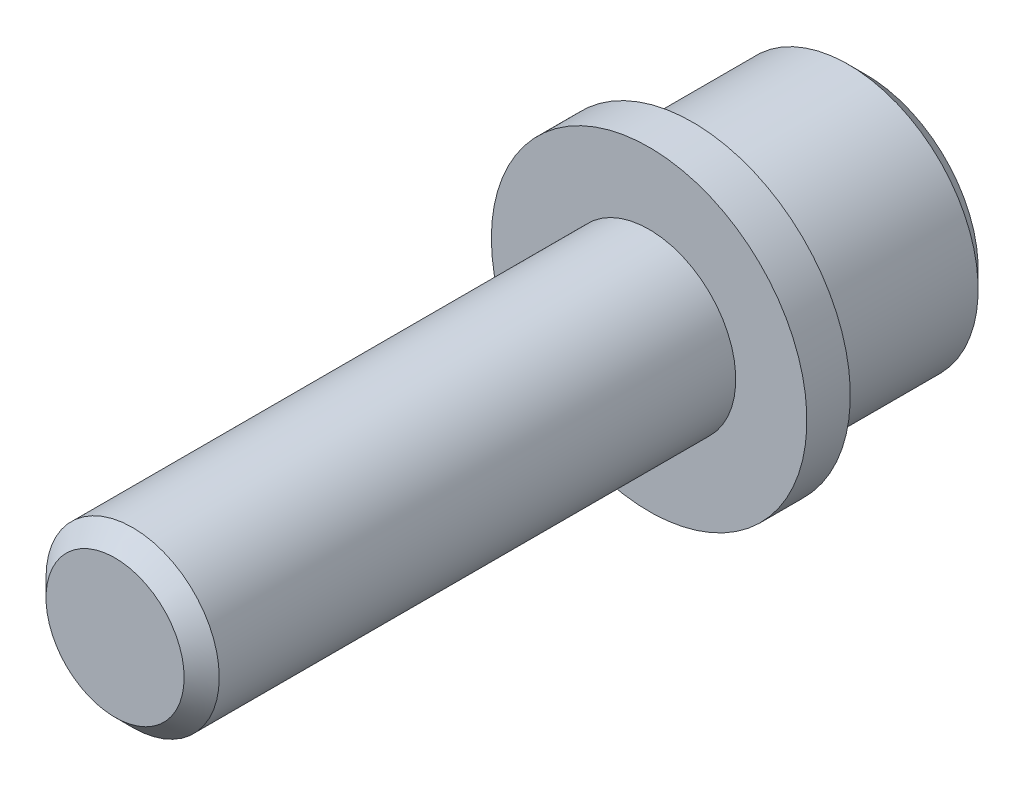
ISO-10303-21;
HEADER;
FILE_DESCRIPTION(('STEP AP214'),'2;1');
FILE_NAME('part.step','',(''),(''),'','','');
FILE_SCHEMA(('AUTOMOTIVE_DESIGN { 1 0 10303 214 1 1 1 1 }'));
ENDSEC;
DATA;
#1=APPLICATION_CONTEXT('core data for automotive mechanical design processes');
#2=APPLICATION_PROTOCOL_DEFINITION('international standard','automotive_design',2000,#1);
#3=PRODUCT_CONTEXT('',#1,'mechanical');
#4=PRODUCT('Part','Part','',(#3));
#5=PRODUCT_RELATED_PRODUCT_CATEGORY('part','',(#4));
#6=PRODUCT_DEFINITION_FORMATION('','',#4);
#7=PRODUCT_DEFINITION_CONTEXT('part definition',#1,'design');
#8=PRODUCT_DEFINITION('design','',#6,#7);
#9=PRODUCT_DEFINITION_SHAPE('','',#8);
#10=(LENGTH_UNIT() NAMED_UNIT(*) SI_UNIT(.MILLI.,.METRE.));
#11=(NAMED_UNIT(*) PLANE_ANGLE_UNIT() SI_UNIT($,.RADIAN.));
#12=(NAMED_UNIT(*) SI_UNIT($,.STERADIAN.) SOLID_ANGLE_UNIT());
#13=UNCERTAINTY_MEASURE_WITH_UNIT(LENGTH_MEASURE(1.E-05),#10,'distance_accuracy_value','');
#14=(GEOMETRIC_REPRESENTATION_CONTEXT(3) GLOBAL_UNCERTAINTY_ASSIGNED_CONTEXT((#13)) GLOBAL_UNIT_ASSIGNED_CONTEXT((#10,
#11,#12)) REPRESENTATION_CONTEXT('',''));
#15=CARTESIAN_POINT('',(0.,0.,0.));
#16=DIRECTION('',(0.,0.,1.));
#17=DIRECTION('',(1.,0.,0.));
#18=AXIS2_PLACEMENT_3D('',#15,#16,#17);
#19=CARTESIAN_POINT('',(0.,0.,-11.5552475137766));
#20=DIRECTION('',(0.,0.,1.));
#21=DIRECTION('',(1.,0.,0.));
#22=AXIS2_PLACEMENT_3D('',#19,#20,#21);
#23=PLANE('',#22);
#24=CARTESIAN_POINT('',(0.,0.,-11.5552475137766));
#25=DIRECTION('',(0.,0.,1.));
#26=DIRECTION('',(1.,0.,0.));
#27=AXIS2_PLACEMENT_3D('',#24,#25,#26);
#28=CIRCLE('',#27,3.79729999999998);
#29=CARTESIAN_POINT('',(3.79729999999998,0.,-11.5552475137766));
#30=VERTEX_POINT('',#29);
#31=EDGE_CURVE('E186',#30,#30,#28,.T.);
#32=ORIENTED_EDGE('',*,*,#31,.T.);
#33=EDGE_LOOP('',(#32));
#34=FACE_BOUND('',#33,.T.);
#35=ADVANCED_FACE('F41',(#34),#23,.T.);
#36=CARTESIAN_POINT('',(0.,0.,-86.6033406110019));
#37=DIRECTION('',(0.,0.,-1.));
#38=DIRECTION('',(-1.,0.,0.));
#39=AXIS2_PLACEMENT_3D('',#36,#37,#38);
#40=CYLINDRICAL_SURFACE('',#39,4.76249999999999);
#41=CARTESIAN_POINT('',(0.,0.,-12.5204475137766));
#42=DIRECTION('',(0.,0.,1.));
#43=DIRECTION('',(1.,0.,0.));
#44=AXIS2_PLACEMENT_3D('',#41,#42,#43);
#45=CIRCLE('',#44,4.76249999999999);
#46=CARTESIAN_POINT('',(4.76249999999999,0.,-12.5204475137766));
#47=VERTEX_POINT('',#46);
#48=EDGE_CURVE('E182',#47,#47,#45,.F.);
#49=ORIENTED_EDGE('',*,*,#48,.T.);
#50=EDGE_LOOP('',(#49));
#51=FACE_BOUND('',#50,.T.);
#52=CARTESIAN_POINT('',(0.,0.,-40.9176475137766));
#53=DIRECTION('',(0.,0.,-1.));
#54=DIRECTION('',(-1.,0.,0.));
#55=AXIS2_PLACEMENT_3D('',#52,#53,#54);
#56=CIRCLE('',#55,4.76249999999999);
#57=CARTESIAN_POINT('',(-4.76249999999999,0.,-40.9176475137766));
#58=VERTEX_POINT('',#57);
#59=EDGE_CURVE('E178',#58,#58,#56,.T.);
#60=ORIENTED_EDGE('',*,*,#59,.F.);
#61=EDGE_LOOP('',(#60));
#62=FACE_BOUND('',#61,.T.);
#63=ADVANCED_FACE('F205',(#51,#62),#40,.T.);
#64=CARTESIAN_POINT('',(-4.76249999999999,0.,-40.9176475137766));
#65=DIRECTION('',(0.,0.,1.));
#66=DIRECTION('',(1.,0.,0.));
#67=AXIS2_PLACEMENT_3D('',#64,#65,#66);
#68=PLANE('',#67);
#69=ORIENTED_EDGE('',*,*,#59,.T.);
#70=EDGE_LOOP('',(#69));
#71=FACE_BOUND('',#70,.T.);
#72=CARTESIAN_POINT('',(0.,0.,-40.9176475137766));
#73=DIRECTION('',(0.,0.,-1.));
#74=DIRECTION('',(-1.,0.,0.));
#75=AXIS2_PLACEMENT_3D('',#72,#73,#74);
#76=CIRCLE('',#75,8.67409999999999);
#77=CARTESIAN_POINT('',(-8.67409999999999,0.,-40.9176475137766));
#78=VERTEX_POINT('',#77);
#79=EDGE_CURVE('E174',#78,#78,#76,.T.);
#80=ORIENTED_EDGE('',*,*,#79,.F.);
#81=EDGE_LOOP('',(#80));
#82=FACE_BOUND('',#81,.T.);
#83=ADVANCED_FACE('F211',(#71,#82),#68,.T.);
#84=CARTESIAN_POINT('',(0.,0.,-86.6033406110019));
#85=DIRECTION('',(0.,0.,-1.));
#86=DIRECTION('',(-1.,0.,0.));
#87=AXIS2_PLACEMENT_3D('',#84,#85,#86);
#88=CYLINDRICAL_SURFACE('',#87,8.67409999999999);
#89=ORIENTED_EDGE('',*,*,#79,.T.);
#90=EDGE_LOOP('',(#89));
#91=FACE_BOUND('',#90,.T.);
#92=CARTESIAN_POINT('',(0.,0.,-43.3052475137766));
#93=DIRECTION('',(0.,0.,-1.));
#94=DIRECTION('',(-1.,0.,0.));
#95=AXIS2_PLACEMENT_3D('',#92,#93,#94);
#96=CIRCLE('',#95,8.6741);
#97=CARTESIAN_POINT('',(-8.6741,0.,-43.3052475137766));
#98=VERTEX_POINT('',#97);
#99=EDGE_CURVE('E170',#98,#98,#96,.T.);
#100=ORIENTED_EDGE('',*,*,#99,.F.);
#101=EDGE_LOOP('',(#100));
#102=FACE_BOUND('',#101,.T.);
#103=ADVANCED_FACE('F222',(#91,#102),#88,.T.);
#104=CARTESIAN_POINT('',(-8.6741,0.,-43.3052475137766));
#105=DIRECTION('',(0.,0.,-1.));
#106=DIRECTION('',(-1.,0.,0.));
#107=AXIS2_PLACEMENT_3D('',#104,#105,#106);
#108=PLANE('',#107);
#109=ORIENTED_EDGE('',*,*,#99,.T.);
#110=EDGE_LOOP('',(#109));
#111=FACE_BOUND('',#110,.T.);
#112=CARTESIAN_POINT('',(0.,0.,-43.3052475137766));
#113=DIRECTION('',(0.,0.,-1.));
#114=DIRECTION('',(-1.,0.,0.));
#115=AXIS2_PLACEMENT_3D('',#112,#113,#114);
#116=CIRCLE('',#115,7.14374999999999);
#117=CARTESIAN_POINT('',(-7.14374999999999,0.,-43.3052475137766));
#118=VERTEX_POINT('',#117);
#119=EDGE_CURVE('E157',#118,#118,#116,.T.);
#120=ORIENTED_EDGE('',*,*,#119,.F.);
#121=EDGE_LOOP('',(#120));
#122=FACE_BOUND('',#121,.T.);
#123=ADVANCED_FACE('F226',(#111,#122),#108,.T.);
#124=CARTESIAN_POINT('',(0.,0.,-86.6033406110019));
#125=DIRECTION('',(0.,0.,-1.));
#126=DIRECTION('',(-1.,0.,0.));
#127=AXIS2_PLACEMENT_3D('',#124,#125,#126);
#128=CYLINDRICAL_SURFACE('',#127,7.14374999999999);
#129=CARTESIAN_POINT('',(0.,0.,-51.8650475137766));
#130=DIRECTION('',(0.,0.,-1.));
#131=DIRECTION('',(-1.,0.,0.));
#132=AXIS2_PLACEMENT_3D('',#129,#130,#131);
#133=CIRCLE('',#132,7.14374999999999);
#134=CARTESIAN_POINT('',(-7.14374999999999,0.,-51.8650475137766));
#135=VERTEX_POINT('',#134);
#136=EDGE_CURVE('E11',#135,#135,#133,.F.);
#137=ORIENTED_EDGE('',*,*,#136,.T.);
#138=EDGE_LOOP('',(#137));
#139=FACE_BOUND('',#138,.T.);
#140=ORIENTED_EDGE('',*,*,#119,.T.);
#141=EDGE_LOOP('',(#140));
#142=FACE_BOUND('',#141,.T.);
#143=ADVANCED_FACE('F230',(#139,#142),#128,.T.);
#144=CARTESIAN_POINT('',(-7.14374999999999,0.,-52.8302475137766));
#145=DIRECTION('',(0.,0.,-1.));
#146=DIRECTION('',(-1.,0.,0.));
#147=AXIS2_PLACEMENT_3D('',#144,#145,#146);
#148=PLANE('',#147);
#149=CARTESIAN_POINT('',(0.,0.,-52.8302475137766));
#150=DIRECTION('',(0.,0.,-1.));
#151=DIRECTION('',(-1.,0.,0.));
#152=AXIS2_PLACEMENT_3D('',#149,#150,#151);
#153=CIRCLE('',#152,6.17855);
#154=CARTESIAN_POINT('',(-6.17855,0.,-52.8302475137766));
#155=VERTEX_POINT('',#154);
#156=EDGE_CURVE('E51',#155,#155,#153,.T.);
#157=ORIENTED_EDGE('',*,*,#156,.T.);
#158=EDGE_LOOP('',(#157));
#159=FACE_BOUND('',#158,.T.);
#160=DIRECTION('',(0.5,0.866025403784438,0.));
#161=VECTOR('',#160,1.);
#162=CARTESIAN_POINT('',(-4.54605601959911,0.,-52.8302475137766));
#163=LINE('',#162,#161);
#164=CARTESIAN_POINT('',(-4.54605601959911,0.,-52.8302475137766));
#165=VERTEX_POINT('',#164);
#166=CARTESIAN_POINT('',(-2.27302800979956,3.937,-52.8302475137766));
#167=VERTEX_POINT('',#166);
#168=EDGE_CURVE('E58',#165,#167,#163,.T.);
#169=ORIENTED_EDGE('',*,*,#168,.F.);
#170=DIRECTION('',(-0.5,0.866025403784439,0.));
#171=VECTOR('',#170,1.);
#172=CARTESIAN_POINT('',(-2.27302800979956,-3.937,-52.8302475137766));
#173=LINE('',#172,#171);
#174=CARTESIAN_POINT('',(-2.27302800979956,-3.937,-52.8302475137766));
#175=VERTEX_POINT('',#174);
#176=EDGE_CURVE('E151',#175,#165,#173,.T.);
#177=ORIENTED_EDGE('',*,*,#176,.F.);
#178=DIRECTION('',(-1.,0.,0.));
#179=VECTOR('',#178,1.);
#180=CARTESIAN_POINT('',(2.27302800979955,-3.937,-52.8302475137766));
#181=LINE('',#180,#179);
#182=CARTESIAN_POINT('',(2.27302800979955,-3.937,-52.8302475137766));
#183=VERTEX_POINT('',#182);
#184=EDGE_CURVE('E148',#183,#175,#181,.T.);
#185=ORIENTED_EDGE('',*,*,#184,.F.);
#186=DIRECTION('',(-0.5,-0.866025403784438,0.));
#187=VECTOR('',#186,1.);
#188=CARTESIAN_POINT('',(4.54605601959911,0.,-52.8302475137766));
#189=LINE('',#188,#187);
#190=CARTESIAN_POINT('',(4.54605601959911,0.,-52.8302475137766));
#191=VERTEX_POINT('',#190);
#192=EDGE_CURVE('E106',#191,#183,#189,.T.);
#193=ORIENTED_EDGE('',*,*,#192,.F.);
#194=DIRECTION('',(0.5,-0.866025403784439,0.));
#195=VECTOR('',#194,1.);
#196=CARTESIAN_POINT('',(2.27302800979956,3.937,-52.8302475137766));
#197=LINE('',#196,#195);
#198=CARTESIAN_POINT('',(2.27302800979956,3.937,-52.8302475137766));
#199=VERTEX_POINT('',#198);
#200=EDGE_CURVE('E142',#199,#191,#197,.T.);
#201=ORIENTED_EDGE('',*,*,#200,.F.);
#202=DIRECTION('',(1.,0.,0.));
#203=VECTOR('',#202,1.);
#204=CARTESIAN_POINT('',(-2.27302800979956,3.937,-52.8302475137766));
#205=LINE('',#204,#203);
#206=EDGE_CURVE('E138',#167,#199,#205,.T.);
#207=ORIENTED_EDGE('',*,*,#206,.F.);
#208=EDGE_LOOP('',(#169,#177,#185,#193,#201,#207));
#209=FACE_BOUND('',#208,.T.);
#210=ADVANCED_FACE('F193',(#159,#209),#148,.T.);
#211=CARTESIAN_POINT('',(-4.54605601959911,0.,-46.4802475137766));
#212=DIRECTION('',(-0.866025403784438,0.5,0.));
#213=DIRECTION('',(-0.5,-0.866025403784439,0.));
#214=AXIS2_PLACEMENT_3D('',#211,#212,#213);
#215=PLANE('',#214);
#216=ORIENTED_EDGE('',*,*,#168,.T.);
#217=DIRECTION('',(0.,0.,-1.));
#218=VECTOR('',#217,1.);
#219=CARTESIAN_POINT('',(-2.27302800979956,3.937,-46.4802475137766));
#220=LINE('',#219,#218);
#221=CARTESIAN_POINT('',(-2.27302800979956,3.937,-46.4802475137766));
#222=VERTEX_POINT('',#221);
#223=EDGE_CURVE('E88',#222,#167,#220,.T.);
#224=ORIENTED_EDGE('',*,*,#223,.F.);
#225=DIRECTION('',(0.5,0.866025403784438,0.));
#226=VECTOR('',#225,1.);
#227=CARTESIAN_POINT('',(-4.54605601959911,0.,-46.4802475137766));
#228=LINE('',#227,#226);
#229=CARTESIAN_POINT('',(-4.54605601959911,0.,-46.4802475137766));
#230=VERTEX_POINT('',#229);
#231=EDGE_CURVE('E154',#230,#222,#228,.T.);
#232=ORIENTED_EDGE('',*,*,#231,.F.);
#233=DIRECTION('',(0.,0.,-1.));
#234=VECTOR('',#233,1.);
#235=CARTESIAN_POINT('',(-4.54605601959911,0.,-46.4802475137766));
#236=LINE('',#235,#234);
#237=EDGE_CURVE('E66',#230,#165,#236,.T.);
#238=ORIENTED_EDGE('',*,*,#237,.T.);
#239=EDGE_LOOP('',(#216,#224,#232,#238));
#240=FACE_BOUND('',#239,.T.);
#241=ADVANCED_FACE('F237',(#240),#215,.F.);
#242=CARTESIAN_POINT('',(-2.27302800979956,-3.937,-46.4802475137766));
#243=DIRECTION('',(-0.866025403784439,-0.5,0.));
#244=DIRECTION('',(0.5,-0.866025403784439,0.));
#245=AXIS2_PLACEMENT_3D('',#242,#243,#244);
#246=PLANE('',#245);
#247=ORIENTED_EDGE('',*,*,#176,.T.);
#248=ORIENTED_EDGE('',*,*,#237,.F.);
#249=DIRECTION('',(-0.5,0.866025403784439,0.));
#250=VECTOR('',#249,1.);
#251=CARTESIAN_POINT('',(-2.27302800979956,-3.937,-46.4802475137766));
#252=LINE('',#251,#250);
#253=CARTESIAN_POINT('',(-2.27302800979956,-3.937,-46.4802475137766));
#254=VERTEX_POINT('',#253);
#255=EDGE_CURVE('E120',#254,#230,#252,.T.);
#256=ORIENTED_EDGE('',*,*,#255,.F.);
#257=DIRECTION('',(0.,0.,-1.));
#258=VECTOR('',#257,1.);
#259=CARTESIAN_POINT('',(-2.27302800979956,-3.937,-46.4802475137766));
#260=LINE('',#259,#258);
#261=EDGE_CURVE('E111',#254,#175,#260,.T.);
#262=ORIENTED_EDGE('',*,*,#261,.T.);
#263=EDGE_LOOP('',(#247,#248,#256,#262));
#264=FACE_BOUND('',#263,.T.);
#265=ADVANCED_FACE('F240',(#264),#246,.F.);
#266=CARTESIAN_POINT('',(2.27302800979955,-3.937,-46.4802475137766));
#267=DIRECTION('',(0.,-1.,0.));
#268=DIRECTION('',(1.,0.,0.));
#269=AXIS2_PLACEMENT_3D('',#266,#267,#268);
#270=PLANE('',#269);
#271=ORIENTED_EDGE('',*,*,#184,.T.);
#272=ORIENTED_EDGE('',*,*,#261,.F.);
#273=DIRECTION('',(-1.,0.,0.));
#274=VECTOR('',#273,1.);
#275=CARTESIAN_POINT('',(2.27302800979955,-3.937,-46.4802475137766));
#276=LINE('',#275,#274);
#277=CARTESIAN_POINT('',(2.27302800979955,-3.937,-46.4802475137766));
#278=VERTEX_POINT('',#277);
#279=EDGE_CURVE('E115',#278,#254,#276,.T.);
#280=ORIENTED_EDGE('',*,*,#279,.F.);
#281=DIRECTION('',(0.,0.,-1.));
#282=VECTOR('',#281,1.);
#283=CARTESIAN_POINT('',(2.27302800979955,-3.937,-46.4802475137766));
#284=LINE('',#283,#282);
#285=EDGE_CURVE('E99',#278,#183,#284,.T.);
#286=ORIENTED_EDGE('',*,*,#285,.T.);
#287=EDGE_LOOP('',(#271,#272,#280,#286));
#288=FACE_BOUND('',#287,.T.);
#289=ADVANCED_FACE('F116',(#288),#270,.F.);
#290=CARTESIAN_POINT('',(4.54605601959911,0.,-46.4802475137766));
#291=DIRECTION('',(0.866025403784438,-0.5,0.));
#292=DIRECTION('',(0.5,0.866025403784438,0.));
#293=AXIS2_PLACEMENT_3D('',#290,#291,#292);
#294=PLANE('',#293);
#295=ORIENTED_EDGE('',*,*,#192,.T.);
#296=ORIENTED_EDGE('',*,*,#285,.F.);
#297=DIRECTION('',(-0.5,-0.866025403784438,0.));
#298=VECTOR('',#297,1.);
#299=CARTESIAN_POINT('',(4.54605601959911,0.,-46.4802475137766));
#300=LINE('',#299,#298);
#301=CARTESIAN_POINT('',(4.54605601959911,0.,-46.4802475137766));
#302=VERTEX_POINT('',#301);
#303=EDGE_CURVE('E103',#302,#278,#300,.T.);
#304=ORIENTED_EDGE('',*,*,#303,.F.);
#305=DIRECTION('',(0.,0.,-1.));
#306=VECTOR('',#305,1.);
#307=CARTESIAN_POINT('',(4.54605601959911,0.,-46.4802475137766));
#308=LINE('',#307,#306);
#309=EDGE_CURVE('E112',#302,#191,#308,.T.);
#310=ORIENTED_EDGE('',*,*,#309,.T.);
#311=EDGE_LOOP('',(#295,#296,#304,#310));
#312=FACE_BOUND('',#311,.T.);
#313=ADVANCED_FACE('F101',(#312),#294,.F.);
#314=CARTESIAN_POINT('',(2.27302800979956,3.937,-46.4802475137766));
#315=DIRECTION('',(0.866025403784439,0.5,0.));
#316=DIRECTION('',(-0.5,0.866025403784439,0.));
#317=AXIS2_PLACEMENT_3D('',#314,#315,#316);
#318=PLANE('',#317);
#319=ORIENTED_EDGE('',*,*,#200,.T.);
#320=ORIENTED_EDGE('',*,*,#309,.F.);
#321=DIRECTION('',(0.5,-0.866025403784439,0.));
#322=VECTOR('',#321,1.);
#323=CARTESIAN_POINT('',(2.27302800979956,3.937,-46.4802475137766));
#324=LINE('',#323,#322);
#325=CARTESIAN_POINT('',(2.27302800979956,3.937,-46.4802475137766));
#326=VERTEX_POINT('',#325);
#327=EDGE_CURVE('E126',#326,#302,#324,.T.);
#328=ORIENTED_EDGE('',*,*,#327,.F.);
#329=DIRECTION('',(0.,0.,-1.));
#330=VECTOR('',#329,1.);
#331=CARTESIAN_POINT('',(2.27302800979956,3.937,-46.4802475137766));
#332=LINE('',#331,#330);
#333=EDGE_CURVE('E162',#326,#199,#332,.T.);
#334=ORIENTED_EDGE('',*,*,#333,.T.);
#335=EDGE_LOOP('',(#319,#320,#328,#334));
#336=FACE_BOUND('',#335,.T.);
#337=ADVANCED_FACE('F244',(#336),#318,.F.);
#338=CARTESIAN_POINT('',(-2.27302800979956,3.937,-46.4802475137766));
#339=DIRECTION('',(0.,1.,0.));
#340=DIRECTION('',(0.,0.,1.));
#341=AXIS2_PLACEMENT_3D('',#338,#339,#340);
#342=PLANE('',#341);
#343=ORIENTED_EDGE('',*,*,#206,.T.);
#344=ORIENTED_EDGE('',*,*,#333,.F.);
#345=DIRECTION('',(1.,0.,0.));
#346=VECTOR('',#345,1.);
#347=CARTESIAN_POINT('',(-2.27302800979956,3.937,-46.4802475137766));
#348=LINE('',#347,#346);
#349=EDGE_CURVE('E130',#222,#326,#348,.T.);
#350=ORIENTED_EDGE('',*,*,#349,.F.);
#351=ORIENTED_EDGE('',*,*,#223,.T.);
#352=EDGE_LOOP('',(#343,#344,#350,#351));
#353=FACE_BOUND('',#352,.T.);
#354=ADVANCED_FACE('F241',(#353),#342,.F.);
#355=CARTESIAN_POINT('',(0.,0.,-46.4802475137766));
#356=DIRECTION('',(0.,0.,-1.));
#357=DIRECTION('',(-1.,0.,0.));
#358=AXIS2_PLACEMENT_3D('',#355,#356,#357);
#359=PLANE('',#358);
#360=ORIENTED_EDGE('',*,*,#231,.T.);
#361=ORIENTED_EDGE('',*,*,#349,.T.);
#362=ORIENTED_EDGE('',*,*,#327,.T.);
#363=ORIENTED_EDGE('',*,*,#303,.T.);
#364=ORIENTED_EDGE('',*,*,#279,.T.);
#365=ORIENTED_EDGE('',*,*,#255,.T.);
#366=EDGE_LOOP('',(#360,#361,#362,#363,#364,#365));
#367=FACE_BOUND('',#366,.T.);
#368=ADVANCED_FACE('F123',(#367),#359,.T.);
#369=CARTESIAN_POINT('',(0.,0.,-12.5204475137766));
#370=DIRECTION('',(0.,0.,-1.));
#371=DIRECTION('',(-1.,0.,0.));
#372=AXIS2_PLACEMENT_3D('',#369,#370,#371);
#373=CONICAL_SURFACE('',#372,4.76249999999999,0.785398163397451);
#374=ORIENTED_EDGE('',*,*,#31,.F.);
#375=EDGE_LOOP('',(#374));
#376=FACE_BOUND('',#375,.T.);
#377=ORIENTED_EDGE('',*,*,#48,.F.);
#378=EDGE_LOOP('',(#377));
#379=FACE_BOUND('',#378,.T.);
#380=ADVANCED_FACE('F197',(#376,#379),#373,.T.);
#381=CARTESIAN_POINT('',(0.,0.,-52.8302475137766));
#382=DIRECTION('',(0.,0.,1.));
#383=DIRECTION('',(1.,0.,0.));
#384=AXIS2_PLACEMENT_3D('',#381,#382,#383);
#385=CONICAL_SURFACE('',#384,6.17855,0.785398163397445);
#386=ORIENTED_EDGE('',*,*,#136,.F.);
#387=EDGE_LOOP('',(#386));
#388=FACE_BOUND('',#387,.T.);
#389=ORIENTED_EDGE('',*,*,#156,.F.);
#390=EDGE_LOOP('',(#389));
#391=FACE_BOUND('',#390,.T.);
#392=ADVANCED_FACE('F44',(#388,#391),#385,.T.);
#393=CLOSED_SHELL('',(#35,#63,#83,#103,#123,#143,#210,#241,#265,#289,#313,#337,#354,#368,#380,#392));
#394=MANIFOLD_SOLID_BREP('B2',#393);
#395=ADVANCED_BREP_SHAPE_REPRESENTATION('',(#18,#394),#14);
#396=SHAPE_DEFINITION_REPRESENTATION(#9,#395);
ENDSEC;
END-ISO-10303-21;
